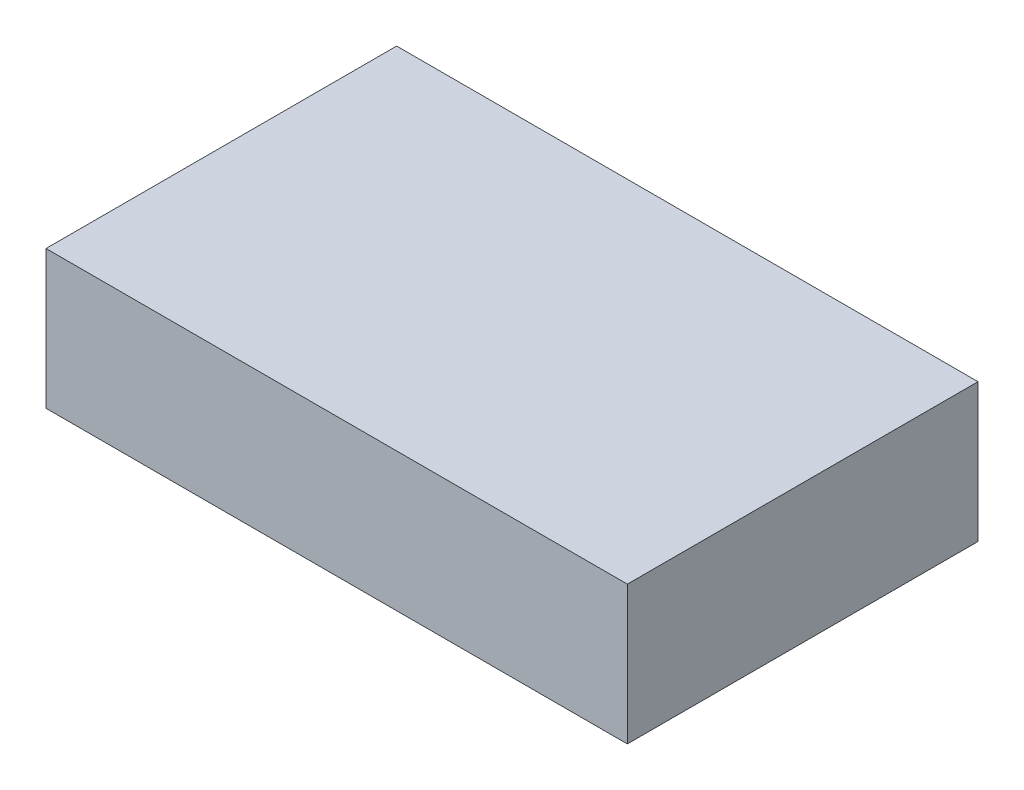
ISO-10303-21;
HEADER;
FILE_DESCRIPTION(('STEP AP214'),'2;1');
FILE_NAME('part.step','',(''),(''),'','','');
FILE_SCHEMA(('AUTOMOTIVE_DESIGN { 1 0 10303 214 1 1 1 1 }'));
ENDSEC;
DATA;
#1=APPLICATION_CONTEXT('core data for automotive mechanical design processes');
#2=APPLICATION_PROTOCOL_DEFINITION('international standard','automotive_design',2000,#1);
#3=PRODUCT_CONTEXT('',#1,'mechanical');
#4=PRODUCT('Part','Part','',(#3));
#5=PRODUCT_RELATED_PRODUCT_CATEGORY('part','',(#4));
#6=PRODUCT_DEFINITION_FORMATION('','',#4);
#7=PRODUCT_DEFINITION_CONTEXT('part definition',#1,'design');
#8=PRODUCT_DEFINITION('design','',#6,#7);
#9=PRODUCT_DEFINITION_SHAPE('','',#8);
#10=(LENGTH_UNIT() NAMED_UNIT(*) SI_UNIT(.MILLI.,.METRE.));
#11=(NAMED_UNIT(*) PLANE_ANGLE_UNIT() SI_UNIT($,.RADIAN.));
#12=(NAMED_UNIT(*) SI_UNIT($,.STERADIAN.) SOLID_ANGLE_UNIT());
#13=UNCERTAINTY_MEASURE_WITH_UNIT(LENGTH_MEASURE(1.E-05),#10,'distance_accuracy_value','');
#14=(GEOMETRIC_REPRESENTATION_CONTEXT(3) GLOBAL_UNCERTAINTY_ASSIGNED_CONTEXT((#13)) GLOBAL_UNIT_ASSIGNED_CONTEXT((#10,
#11,#12)) REPRESENTATION_CONTEXT('',''));
#15=CARTESIAN_POINT('',(0.,0.,0.));
#16=DIRECTION('',(0.,0.,1.));
#17=DIRECTION('',(1.,0.,0.));
#18=AXIS2_PLACEMENT_3D('',#15,#16,#17);
#19=CARTESIAN_POINT('',(80.01,38.1,-48.26));
#20=DIRECTION('',(-1.,0.,0.));
#21=DIRECTION('',(0.,0.,1.));
#22=AXIS2_PLACEMENT_3D('',#19,#20,#21);
#23=PLANE('',#22);
#24=DIRECTION('',(0.,0.,-1.));
#25=VECTOR('',#24,1.);
#26=CARTESIAN_POINT('',(80.01,0.,-48.26));
#27=LINE('',#26,#25);
#28=CARTESIAN_POINT('',(80.01,0.,48.26));
#29=VERTEX_POINT('',#28);
#30=CARTESIAN_POINT('',(80.01,0.,-48.26));
#31=VERTEX_POINT('',#30);
#32=EDGE_CURVE('E96',#29,#31,#27,.T.);
#33=ORIENTED_EDGE('',*,*,#32,.T.);
#34=DIRECTION('',(0.,-1.,0.));
#35=VECTOR('',#34,1.);
#36=CARTESIAN_POINT('',(80.01,38.1,-48.26));
#37=LINE('',#36,#35);
#38=CARTESIAN_POINT('',(80.01,38.1,-48.26));
#39=VERTEX_POINT('',#38);
#40=EDGE_CURVE('E11',#39,#31,#37,.T.);
#41=ORIENTED_EDGE('',*,*,#40,.F.);
#42=DIRECTION('',(0.,0.,-1.));
#43=VECTOR('',#42,1.);
#44=CARTESIAN_POINT('',(80.01,38.1,-48.26));
#45=LINE('',#44,#43);
#46=CARTESIAN_POINT('',(80.01,38.1,48.26));
#47=VERTEX_POINT('',#46);
#48=EDGE_CURVE('E84',#47,#39,#45,.T.);
#49=ORIENTED_EDGE('',*,*,#48,.F.);
#50=DIRECTION('',(0.,-1.,0.));
#51=VECTOR('',#50,1.);
#52=CARTESIAN_POINT('',(80.01,38.1,48.26));
#53=LINE('',#52,#51);
#54=EDGE_CURVE('E92',#47,#29,#53,.T.);
#55=ORIENTED_EDGE('',*,*,#54,.T.);
#56=EDGE_LOOP('',(#33,#41,#49,#55));
#57=FACE_BOUND('',#56,.T.);
#58=ADVANCED_FACE('F33',(#57),#23,.F.);
#59=CARTESIAN_POINT('',(80.01,38.1,-48.26));
#60=DIRECTION('',(0.,0.,1.));
#61=DIRECTION('',(1.,0.,0.));
#62=AXIS2_PLACEMENT_3D('',#59,#60,#61);
#63=PLANE('',#62);
#64=DIRECTION('',(-1.,0.,0.));
#65=VECTOR('',#64,1.);
#66=CARTESIAN_POINT('',(80.01,0.,-48.26));
#67=LINE('',#66,#65);
#68=CARTESIAN_POINT('',(-80.01,0.,-48.26));
#69=VERTEX_POINT('',#68);
#70=EDGE_CURVE('E88',#31,#69,#67,.T.);
#71=ORIENTED_EDGE('',*,*,#70,.T.);
#72=DIRECTION('',(0.,-1.,0.));
#73=VECTOR('',#72,1.);
#74=CARTESIAN_POINT('',(-80.01,38.1,-48.26));
#75=LINE('',#74,#73);
#76=CARTESIAN_POINT('',(-80.01,38.1,-48.26));
#77=VERTEX_POINT('',#76);
#78=EDGE_CURVE('E41',#77,#69,#75,.T.);
#79=ORIENTED_EDGE('',*,*,#78,.F.);
#80=DIRECTION('',(-1.,0.,0.));
#81=VECTOR('',#80,1.);
#82=CARTESIAN_POINT('',(80.01,38.1,-48.26));
#83=LINE('',#82,#81);
#84=EDGE_CURVE('E79',#39,#77,#83,.T.);
#85=ORIENTED_EDGE('',*,*,#84,.F.);
#86=ORIENTED_EDGE('',*,*,#40,.T.);
#87=EDGE_LOOP('',(#71,#79,#85,#86));
#88=FACE_BOUND('',#87,.T.);
#89=ADVANCED_FACE('F87',(#88),#63,.F.);
#90=CARTESIAN_POINT('',(-80.01,38.1,-48.26));
#91=DIRECTION('',(1.,0.,0.));
#92=DIRECTION('',(0.,0.,-1.));
#93=AXIS2_PLACEMENT_3D('',#90,#91,#92);
#94=PLANE('',#93);
#95=DIRECTION('',(0.,0.,1.));
#96=VECTOR('',#95,1.);
#97=CARTESIAN_POINT('',(-80.01,0.,-48.26));
#98=LINE('',#97,#96);
#99=CARTESIAN_POINT('',(-80.01,0.,48.26));
#100=VERTEX_POINT('',#99);
#101=EDGE_CURVE('E66',#69,#100,#98,.T.);
#102=ORIENTED_EDGE('',*,*,#101,.T.);
#103=DIRECTION('',(0.,-1.,0.));
#104=VECTOR('',#103,1.);
#105=CARTESIAN_POINT('',(-80.01,38.1,48.26));
#106=LINE('',#105,#104);
#107=CARTESIAN_POINT('',(-80.01,38.1,48.26));
#108=VERTEX_POINT('',#107);
#109=EDGE_CURVE('E89',#108,#100,#106,.T.);
#110=ORIENTED_EDGE('',*,*,#109,.F.);
#111=DIRECTION('',(0.,0.,1.));
#112=VECTOR('',#111,1.);
#113=CARTESIAN_POINT('',(-80.01,38.1,-48.26));
#114=LINE('',#113,#112);
#115=EDGE_CURVE('E82',#77,#108,#114,.T.);
#116=ORIENTED_EDGE('',*,*,#115,.F.);
#117=ORIENTED_EDGE('',*,*,#78,.T.);
#118=EDGE_LOOP('',(#102,#110,#116,#117));
#119=FACE_BOUND('',#118,.T.);
#120=ADVANCED_FACE('F90',(#119),#94,.F.);
#121=CARTESIAN_POINT('',(80.01,38.1,48.26));
#122=DIRECTION('',(0.,0.,-1.));
#123=DIRECTION('',(-1.,0.,0.));
#124=AXIS2_PLACEMENT_3D('',#121,#122,#123);
#125=PLANE('',#124);
#126=DIRECTION('',(1.,0.,0.));
#127=VECTOR('',#126,1.);
#128=CARTESIAN_POINT('',(80.01,0.,48.26));
#129=LINE('',#128,#127);
#130=EDGE_CURVE('E72',#100,#29,#129,.T.);
#131=ORIENTED_EDGE('',*,*,#130,.T.);
#132=ORIENTED_EDGE('',*,*,#54,.F.);
#133=DIRECTION('',(1.,0.,0.));
#134=VECTOR('',#133,1.);
#135=CARTESIAN_POINT('',(80.01,38.1,48.26));
#136=LINE('',#135,#134);
#137=EDGE_CURVE('E49',#108,#47,#136,.T.);
#138=ORIENTED_EDGE('',*,*,#137,.F.);
#139=ORIENTED_EDGE('',*,*,#109,.T.);
#140=EDGE_LOOP('',(#131,#132,#138,#139));
#141=FACE_BOUND('',#140,.T.);
#142=ADVANCED_FACE('F103',(#141),#125,.F.);
#143=CARTESIAN_POINT('',(0.,38.1,0.));
#144=DIRECTION('',(0.,-1.,0.));
#145=DIRECTION('',(0.,0.,-1.));
#146=AXIS2_PLACEMENT_3D('',#143,#144,#145);
#147=PLANE('',#146);
#148=ORIENTED_EDGE('',*,*,#48,.T.);
#149=ORIENTED_EDGE('',*,*,#84,.T.);
#150=ORIENTED_EDGE('',*,*,#115,.T.);
#151=ORIENTED_EDGE('',*,*,#137,.T.);
#152=EDGE_LOOP('',(#148,#149,#150,#151));
#153=FACE_BOUND('',#152,.T.);
#154=ADVANCED_FACE('F80',(#153),#147,.F.);
#155=CARTESIAN_POINT('',(0.,0.,0.));
#156=DIRECTION('',(0.,-1.,0.));
#157=DIRECTION('',(0.,0.,-1.));
#158=AXIS2_PLACEMENT_3D('',#155,#156,#157);
#159=PLANE('',#158);
#160=ORIENTED_EDGE('',*,*,#32,.F.);
#161=ORIENTED_EDGE('',*,*,#130,.F.);
#162=ORIENTED_EDGE('',*,*,#101,.F.);
#163=ORIENTED_EDGE('',*,*,#70,.F.);
#164=EDGE_LOOP('',(#160,#161,#162,#163));
#165=FACE_BOUND('',#164,.T.);
#166=ADVANCED_FACE('F106',(#165),#159,.T.);
#167=CLOSED_SHELL('',(#58,#89,#120,#142,#154,#166));
#168=MANIFOLD_SOLID_BREP('B2',#167);
#169=ADVANCED_BREP_SHAPE_REPRESENTATION('',(#18,#168),#14);
#170=SHAPE_DEFINITION_REPRESENTATION(#9,#169);
ENDSEC;
END-ISO-10303-21;
